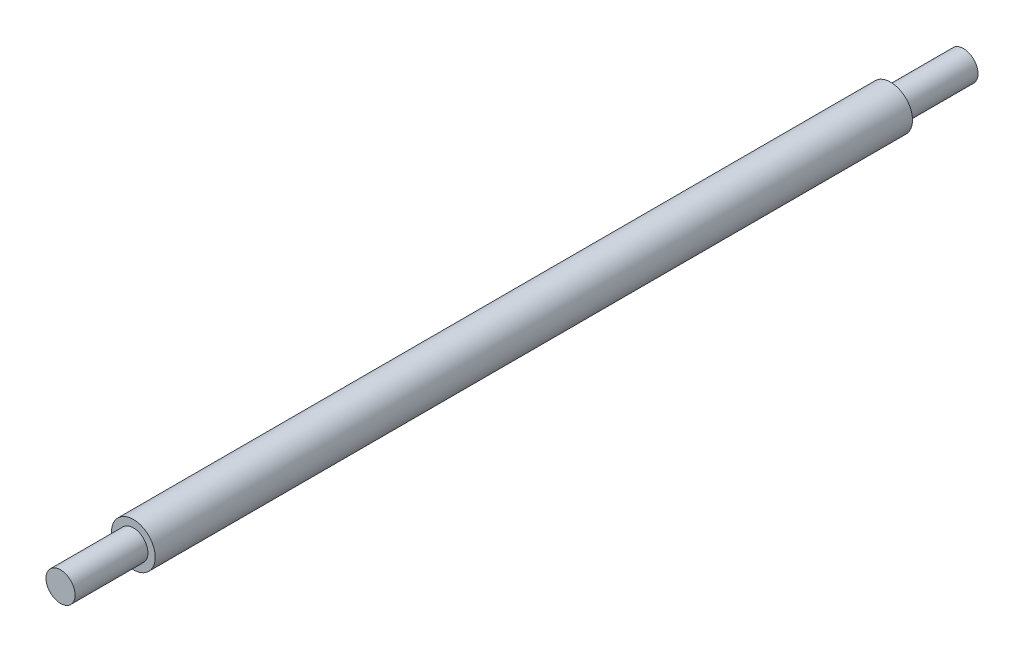
ISO-10303-21;
HEADER;
FILE_DESCRIPTION(('STEP AP214'),'2;1');
FILE_NAME('part.step','',(''),(''),'','','');
FILE_SCHEMA(('AUTOMOTIVE_DESIGN { 1 0 10303 214 1 1 1 1 }'));
ENDSEC;
DATA;
#1=APPLICATION_CONTEXT('core data for automotive mechanical design processes');
#2=APPLICATION_PROTOCOL_DEFINITION('international standard','automotive_design',2000,#1);
#3=PRODUCT_CONTEXT('',#1,'mechanical');
#4=PRODUCT('Part','Part','',(#3));
#5=PRODUCT_RELATED_PRODUCT_CATEGORY('part','',(#4));
#6=PRODUCT_DEFINITION_FORMATION('','',#4);
#7=PRODUCT_DEFINITION_CONTEXT('part definition',#1,'design');
#8=PRODUCT_DEFINITION('design','',#6,#7);
#9=PRODUCT_DEFINITION_SHAPE('','',#8);
#10=(LENGTH_UNIT() NAMED_UNIT(*) SI_UNIT(.MILLI.,.METRE.));
#11=(NAMED_UNIT(*) PLANE_ANGLE_UNIT() SI_UNIT($,.RADIAN.));
#12=(NAMED_UNIT(*) SI_UNIT($,.STERADIAN.) SOLID_ANGLE_UNIT());
#13=UNCERTAINTY_MEASURE_WITH_UNIT(LENGTH_MEASURE(1.E-05),#10,'distance_accuracy_value','');
#14=(GEOMETRIC_REPRESENTATION_CONTEXT(3) GLOBAL_UNCERTAINTY_ASSIGNED_CONTEXT((#13)) GLOBAL_UNIT_ASSIGNED_CONTEXT((#10,
#11,#12)) REPRESENTATION_CONTEXT('',''));
#15=CARTESIAN_POINT('',(0.,0.,0.));
#16=DIRECTION('',(0.,0.,1.));
#17=DIRECTION('',(1.,0.,0.));
#18=AXIS2_PLACEMENT_3D('',#15,#16,#17);
#19=CARTESIAN_POINT('',(0.,0.,52.));
#20=DIRECTION('',(0.,0.,-1.));
#21=DIRECTION('',(-1.,0.,0.));
#22=AXIS2_PLACEMENT_3D('',#19,#20,#21);
#23=CYLINDRICAL_SURFACE('',#22,3.);
#24=CARTESIAN_POINT('',(0.,0.,52.));
#25=DIRECTION('',(0.,0.,1.));
#26=DIRECTION('',(1.,0.,0.));
#27=AXIS2_PLACEMENT_3D('',#24,#25,#26);
#28=CIRCLE('',#27,3.);
#29=CARTESIAN_POINT('',(3.,0.,52.));
#30=VERTEX_POINT('',#29);
#31=EDGE_CURVE('E42',#30,#30,#28,.T.);
#32=ORIENTED_EDGE('',*,*,#31,.F.);
#33=EDGE_LOOP('',(#32));
#34=FACE_BOUND('',#33,.T.);
#35=CARTESIAN_POINT('',(0.,0.,-52.));
#36=DIRECTION('',(0.,0.,1.));
#37=DIRECTION('',(1.,0.,0.));
#38=AXIS2_PLACEMENT_3D('',#35,#36,#37);
#39=CIRCLE('',#38,3.);
#40=CARTESIAN_POINT('',(3.,0.,-52.));
#41=VERTEX_POINT('',#40);
#42=EDGE_CURVE('E33',#41,#41,#39,.T.);
#43=ORIENTED_EDGE('',*,*,#42,.T.);
#44=EDGE_LOOP('',(#43));
#45=FACE_BOUND('',#44,.T.);
#46=ADVANCED_FACE('F30',(#34,#45),#23,.T.);
#47=CARTESIAN_POINT('',(0.,0.,52.));
#48=DIRECTION('',(0.,0.,1.));
#49=DIRECTION('',(1.,0.,0.));
#50=AXIS2_PLACEMENT_3D('',#47,#48,#49);
#51=PLANE('',#50);
#52=CARTESIAN_POINT('',(0.,0.,52.));
#53=DIRECTION('',(0.,0.,1.));
#54=DIRECTION('',(1.,0.,0.));
#55=AXIS2_PLACEMENT_3D('',#52,#53,#54);
#56=CIRCLE('',#55,2.);
#57=CARTESIAN_POINT('',(2.,0.,52.));
#58=VERTEX_POINT('',#57);
#59=EDGE_CURVE('E37',#58,#58,#56,.T.);
#60=ORIENTED_EDGE('',*,*,#59,.F.);
#61=EDGE_LOOP('',(#60));
#62=FACE_BOUND('',#61,.T.);
#63=ORIENTED_EDGE('',*,*,#31,.T.);
#64=EDGE_LOOP('',(#63));
#65=FACE_BOUND('',#64,.T.);
#66=ADVANCED_FACE('F59',(#62,#65),#51,.T.);
#67=CARTESIAN_POINT('',(0.,0.,-52.));
#68=DIRECTION('',(0.,0.,1.));
#69=DIRECTION('',(1.,0.,0.));
#70=AXIS2_PLACEMENT_3D('',#67,#68,#69);
#71=PLANE('',#70);
#72=CARTESIAN_POINT('',(0.,0.,-52.));
#73=DIRECTION('',(0.,0.,-1.));
#74=DIRECTION('',(-1.,0.,0.));
#75=AXIS2_PLACEMENT_3D('',#72,#73,#74);
#76=CIRCLE('',#75,2.);
#77=CARTESIAN_POINT('',(-2.,0.,-52.));
#78=VERTEX_POINT('',#77);
#79=EDGE_CURVE('E10',#78,#78,#76,.T.);
#80=ORIENTED_EDGE('',*,*,#79,.F.);
#81=EDGE_LOOP('',(#80));
#82=FACE_BOUND('',#81,.T.);
#83=ORIENTED_EDGE('',*,*,#42,.F.);
#84=EDGE_LOOP('',(#83));
#85=FACE_BOUND('',#84,.T.);
#86=ADVANCED_FACE('F56',(#82,#85),#71,.F.);
#87=CARTESIAN_POINT('',(0.,0.,62.));
#88=DIRECTION('',(0.,0.,-1.));
#89=DIRECTION('',(-1.,0.,0.));
#90=AXIS2_PLACEMENT_3D('',#87,#88,#89);
#91=CYLINDRICAL_SURFACE('',#90,2.);
#92=CARTESIAN_POINT('',(0.,0.,62.));
#93=DIRECTION('',(0.,0.,1.));
#94=DIRECTION('',(1.,0.,0.));
#95=AXIS2_PLACEMENT_3D('',#92,#93,#94);
#96=CIRCLE('',#95,2.);
#97=CARTESIAN_POINT('',(2.,0.,62.));
#98=VERTEX_POINT('',#97);
#99=EDGE_CURVE('E47',#98,#98,#96,.T.);
#100=ORIENTED_EDGE('',*,*,#99,.F.);
#101=EDGE_LOOP('',(#100));
#102=FACE_BOUND('',#101,.T.);
#103=ORIENTED_EDGE('',*,*,#59,.T.);
#104=EDGE_LOOP('',(#103));
#105=FACE_BOUND('',#104,.T.);
#106=ADVANCED_FACE('F58',(#102,#105),#91,.T.);
#107=CARTESIAN_POINT('',(0.,0.,62.));
#108=DIRECTION('',(0.,0.,1.));
#109=DIRECTION('',(1.,0.,0.));
#110=AXIS2_PLACEMENT_3D('',#107,#108,#109);
#111=PLANE('',#110);
#112=ORIENTED_EDGE('',*,*,#99,.T.);
#113=EDGE_LOOP('',(#112));
#114=FACE_BOUND('',#113,.T.);
#115=ADVANCED_FACE('F65',(#114),#111,.T.);
#116=CARTESIAN_POINT('',(0.,0.,-62.));
#117=DIRECTION('',(0.,0.,1.));
#118=DIRECTION('',(1.,0.,0.));
#119=AXIS2_PLACEMENT_3D('',#116,#117,#118);
#120=CYLINDRICAL_SURFACE('',#119,2.);
#121=CARTESIAN_POINT('',(0.,0.,-62.));
#122=DIRECTION('',(0.,0.,-1.));
#123=DIRECTION('',(-1.,0.,0.));
#124=AXIS2_PLACEMENT_3D('',#121,#122,#123);
#125=CIRCLE('',#124,2.);
#126=CARTESIAN_POINT('',(-2.,0.,-62.));
#127=VERTEX_POINT('',#126);
#128=EDGE_CURVE('E46',#127,#127,#125,.T.);
#129=ORIENTED_EDGE('',*,*,#128,.F.);
#130=EDGE_LOOP('',(#129));
#131=FACE_BOUND('',#130,.T.);
#132=ORIENTED_EDGE('',*,*,#79,.T.);
#133=EDGE_LOOP('',(#132));
#134=FACE_BOUND('',#133,.T.);
#135=ADVANCED_FACE('F93',(#131,#134),#120,.T.);
#136=CARTESIAN_POINT('',(0.,0.,-62.));
#137=DIRECTION('',(0.,0.,-1.));
#138=DIRECTION('',(-1.,0.,0.));
#139=AXIS2_PLACEMENT_3D('',#136,#137,#138);
#140=PLANE('',#139);
#141=ORIENTED_EDGE('',*,*,#128,.T.);
#142=EDGE_LOOP('',(#141));
#143=FACE_BOUND('',#142,.T.);
#144=ADVANCED_FACE('F107',(#143),#140,.T.);
#145=CLOSED_SHELL('',(#46,#66,#86,#106,#115,#135,#144));
#146=MANIFOLD_SOLID_BREP('B2',#145);
#147=ADVANCED_BREP_SHAPE_REPRESENTATION('',(#18,#146),#14);
#148=SHAPE_DEFINITION_REPRESENTATION(#9,#147);
ENDSEC;
END-ISO-10303-21;
